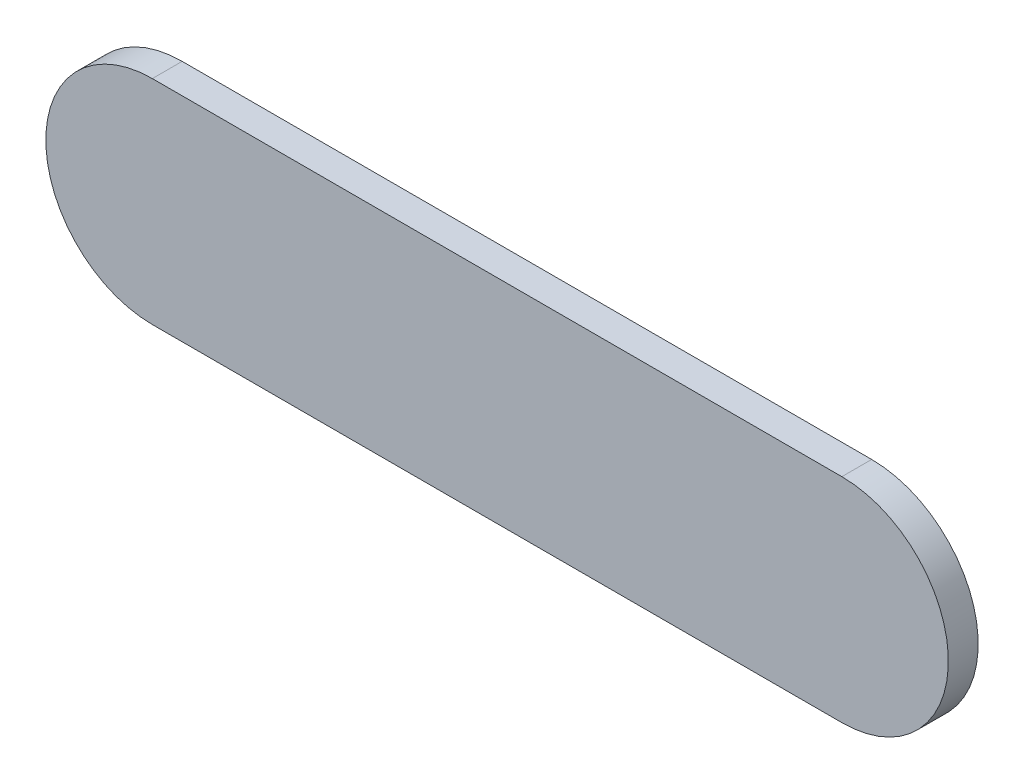
ISO-10303-21;
HEADER;
FILE_DESCRIPTION(('STEP AP214'),'2;1');
FILE_NAME('part.step','',(''),(''),'','','');
FILE_SCHEMA(('AUTOMOTIVE_DESIGN { 1 0 10303 214 1 1 1 1 }'));
ENDSEC;
DATA;
#1=APPLICATION_CONTEXT('core data for automotive mechanical design processes');
#2=APPLICATION_PROTOCOL_DEFINITION('international standard','automotive_design',2000,#1);
#3=PRODUCT_CONTEXT('',#1,'mechanical');
#4=PRODUCT('Part','Part','',(#3));
#5=PRODUCT_RELATED_PRODUCT_CATEGORY('part','',(#4));
#6=PRODUCT_DEFINITION_FORMATION('','',#4);
#7=PRODUCT_DEFINITION_CONTEXT('part definition',#1,'design');
#8=PRODUCT_DEFINITION('design','',#6,#7);
#9=PRODUCT_DEFINITION_SHAPE('','',#8);
#10=(LENGTH_UNIT() NAMED_UNIT(*) SI_UNIT(.MILLI.,.METRE.));
#11=(NAMED_UNIT(*) PLANE_ANGLE_UNIT() SI_UNIT($,.RADIAN.));
#12=(NAMED_UNIT(*) SI_UNIT($,.STERADIAN.) SOLID_ANGLE_UNIT());
#13=UNCERTAINTY_MEASURE_WITH_UNIT(LENGTH_MEASURE(1.E-05),#10,'distance_accuracy_value','');
#14=(GEOMETRIC_REPRESENTATION_CONTEXT(3) GLOBAL_UNCERTAINTY_ASSIGNED_CONTEXT((#13)) GLOBAL_UNIT_ASSIGNED_CONTEXT((#10,
#11,#12)) REPRESENTATION_CONTEXT('',''));
#15=CARTESIAN_POINT('',(0.,0.,0.));
#16=DIRECTION('',(0.,0.,1.));
#17=DIRECTION('',(1.,0.,0.));
#18=AXIS2_PLACEMENT_3D('',#15,#16,#17);
#19=CARTESIAN_POINT('',(91.3170132,102.157022,0.));
#20=DIRECTION('',(0.,1.,0.));
#21=DIRECTION('',(1.,0.,0.));
#22=AXIS2_PLACEMENT_3D('',#19,#20,#21);
#23=PLANE('',#22);
#24=DIRECTION('',(1.,0.,0.));
#25=VECTOR('',#24,1.);
#26=CARTESIAN_POINT('',(91.3170132,102.157022,0.03556));
#27=LINE('',#26,#25);
#28=CARTESIAN_POINT('',(91.3170132,102.157022,0.03556));
#29=VERTEX_POINT('',#28);
#30=CARTESIAN_POINT('',(92.13909436,102.157022,0.03556));
#31=VERTEX_POINT('',#30);
#32=EDGE_CURVE('E11',#29,#31,#27,.T.);
#33=ORIENTED_EDGE('',*,*,#32,.F.);
#34=DIRECTION('',(0.,0.,1.));
#35=VECTOR('',#34,1.);
#36=CARTESIAN_POINT('',(91.3170132,102.157022,0.));
#37=LINE('',#36,#35);
#38=CARTESIAN_POINT('',(91.3170132,102.157022,0.));
#39=VERTEX_POINT('',#38);
#40=EDGE_CURVE('E24',#39,#29,#37,.T.);
#41=ORIENTED_EDGE('',*,*,#40,.F.);
#42=DIRECTION('',(1.,0.,0.));
#43=VECTOR('',#42,1.);
#44=CARTESIAN_POINT('',(91.3170132,102.157022,0.));
#45=LINE('',#44,#43);
#46=CARTESIAN_POINT('',(92.13909436,102.157022,0.));
#47=VERTEX_POINT('',#46);
#48=EDGE_CURVE('E75',#39,#47,#45,.T.);
#49=ORIENTED_EDGE('',*,*,#48,.T.);
#50=DIRECTION('',(0.,0.,1.));
#51=VECTOR('',#50,1.);
#52=CARTESIAN_POINT('',(92.13909436,102.157022,0.));
#53=LINE('',#52,#51);
#54=EDGE_CURVE('E37',#47,#31,#53,.T.);
#55=ORIENTED_EDGE('',*,*,#54,.T.);
#56=EDGE_LOOP('',(#33,#41,#49,#55));
#57=FACE_BOUND('',#56,.T.);
#58=ADVANCED_FACE('F17',(#57),#23,.F.);
#59=CARTESIAN_POINT('',(92.13909436,102.284022,0.));
#60=DIRECTION('',(0.,0.,-1.));
#61=DIRECTION('',(0.,-1.,0.));
#62=AXIS2_PLACEMENT_3D('',#59,#60,#61);
#63=CYLINDRICAL_SURFACE('',#62,0.127);
#64=CARTESIAN_POINT('',(92.13909436,102.284022,0.03556));
#65=DIRECTION('',(0.,0.,1.));
#66=DIRECTION('',(0.,-1.,0.));
#67=AXIS2_PLACEMENT_3D('',#64,#65,#66);
#68=CIRCLE('',#67,0.127);
#69=CARTESIAN_POINT('',(92.13909436,102.411022,0.03556));
#70=VERTEX_POINT('',#69);
#71=EDGE_CURVE('E83',#31,#70,#68,.T.);
#72=ORIENTED_EDGE('',*,*,#71,.F.);
#73=ORIENTED_EDGE('',*,*,#54,.F.);
#74=CARTESIAN_POINT('',(92.13909436,102.284022,0.));
#75=DIRECTION('',(0.,0.,1.));
#76=DIRECTION('',(0.,-1.,0.));
#77=AXIS2_PLACEMENT_3D('',#74,#75,#76);
#78=CIRCLE('',#77,0.127);
#79=CARTESIAN_POINT('',(92.13909436,102.411022,0.));
#80=VERTEX_POINT('',#79);
#81=EDGE_CURVE('E81',#47,#80,#78,.T.);
#82=ORIENTED_EDGE('',*,*,#81,.T.);
#83=DIRECTION('',(0.,0.,1.));
#84=VECTOR('',#83,1.);
#85=CARTESIAN_POINT('',(92.13909436,102.411022,0.));
#86=LINE('',#85,#84);
#87=EDGE_CURVE('E67',#80,#70,#86,.T.);
#88=ORIENTED_EDGE('',*,*,#87,.T.);
#89=EDGE_LOOP('',(#72,#73,#82,#88));
#90=FACE_BOUND('',#89,.T.);
#91=ADVANCED_FACE('F89',(#90),#63,.T.);
#92=CARTESIAN_POINT('',(92.13909436,102.411022,0.));
#93=DIRECTION('',(0.,-1.,0.));
#94=DIRECTION('',(-1.,0.,0.));
#95=AXIS2_PLACEMENT_3D('',#92,#93,#94);
#96=PLANE('',#95);
#97=DIRECTION('',(-1.,0.,0.));
#98=VECTOR('',#97,1.);
#99=CARTESIAN_POINT('',(92.13909436,102.411022,0.03556));
#100=LINE('',#99,#98);
#101=CARTESIAN_POINT('',(91.3170132,102.411022,0.03556));
#102=VERTEX_POINT('',#101);
#103=EDGE_CURVE('E71',#70,#102,#100,.T.);
#104=ORIENTED_EDGE('',*,*,#103,.F.);
#105=ORIENTED_EDGE('',*,*,#87,.F.);
#106=DIRECTION('',(-1.,0.,0.));
#107=VECTOR('',#106,1.);
#108=CARTESIAN_POINT('',(92.13909436,102.411022,0.));
#109=LINE('',#108,#107);
#110=CARTESIAN_POINT('',(91.3170132,102.411022,0.));
#111=VERTEX_POINT('',#110);
#112=EDGE_CURVE('E63',#80,#111,#109,.T.);
#113=ORIENTED_EDGE('',*,*,#112,.T.);
#114=DIRECTION('',(0.,0.,1.));
#115=VECTOR('',#114,1.);
#116=CARTESIAN_POINT('',(91.3170132,102.411022,0.));
#117=LINE('',#116,#115);
#118=EDGE_CURVE('E53',#111,#102,#117,.T.);
#119=ORIENTED_EDGE('',*,*,#118,.T.);
#120=EDGE_LOOP('',(#104,#105,#113,#119));
#121=FACE_BOUND('',#120,.T.);
#122=ADVANCED_FACE('F66',(#121),#96,.F.);
#123=CARTESIAN_POINT('',(91.3170132,102.284022,0.));
#124=DIRECTION('',(0.,0.,-1.));
#125=DIRECTION('',(0.,1.,0.));
#126=AXIS2_PLACEMENT_3D('',#123,#124,#125);
#127=CYLINDRICAL_SURFACE('',#126,0.127000000000005);
#128=CARTESIAN_POINT('',(91.3170132,102.284022,0.03556));
#129=DIRECTION('',(0.,0.,1.));
#130=DIRECTION('',(0.,1.,0.));
#131=AXIS2_PLACEMENT_3D('',#128,#129,#130);
#132=CIRCLE('',#131,0.127000000000005);
#133=EDGE_CURVE('E59',#102,#29,#132,.T.);
#134=ORIENTED_EDGE('',*,*,#133,.F.);
#135=ORIENTED_EDGE('',*,*,#118,.F.);
#136=CARTESIAN_POINT('',(91.3170132,102.284022,0.));
#137=DIRECTION('',(0.,0.,1.));
#138=DIRECTION('',(0.,1.,0.));
#139=AXIS2_PLACEMENT_3D('',#136,#137,#138);
#140=CIRCLE('',#139,0.127000000000005);
#141=EDGE_CURVE('E57',#111,#39,#140,.T.);
#142=ORIENTED_EDGE('',*,*,#141,.T.);
#143=ORIENTED_EDGE('',*,*,#40,.T.);
#144=EDGE_LOOP('',(#134,#135,#142,#143));
#145=FACE_BOUND('',#144,.T.);
#146=ADVANCED_FACE('F55',(#145),#127,.T.);
#147=CARTESIAN_POINT('',(91.3170132,102.157022,0.));
#148=DIRECTION('',(0.,0.,-1.));
#149=DIRECTION('',(-1.,0.,0.));
#150=AXIS2_PLACEMENT_3D('',#147,#148,#149);
#151=PLANE('',#150);
#152=ORIENTED_EDGE('',*,*,#141,.F.);
#153=ORIENTED_EDGE('',*,*,#112,.F.);
#154=ORIENTED_EDGE('',*,*,#81,.F.);
#155=ORIENTED_EDGE('',*,*,#48,.F.);
#156=EDGE_LOOP('',(#152,#153,#154,#155));
#157=FACE_BOUND('',#156,.T.);
#158=ADVANCED_FACE('F74',(#157),#151,.T.);
#159=CARTESIAN_POINT('',(91.3170132,102.157022,0.03556));
#160=DIRECTION('',(0.,0.,-1.));
#161=DIRECTION('',(-1.,0.,0.));
#162=AXIS2_PLACEMENT_3D('',#159,#160,#161);
#163=PLANE('',#162);
#164=ORIENTED_EDGE('',*,*,#32,.T.);
#165=ORIENTED_EDGE('',*,*,#71,.T.);
#166=ORIENTED_EDGE('',*,*,#103,.T.);
#167=ORIENTED_EDGE('',*,*,#133,.T.);
#168=EDGE_LOOP('',(#164,#165,#166,#167));
#169=FACE_BOUND('',#168,.T.);
#170=ADVANCED_FACE('F91',(#169),#163,.F.);
#171=CLOSED_SHELL('',(#58,#91,#122,#146,#158,#170));
#172=MANIFOLD_SOLID_BREP('B1',#171);
#173=ADVANCED_BREP_SHAPE_REPRESENTATION('',(#18,#172),#14);
#174=SHAPE_DEFINITION_REPRESENTATION(#9,#173);
ENDSEC;
END-ISO-10303-21;
